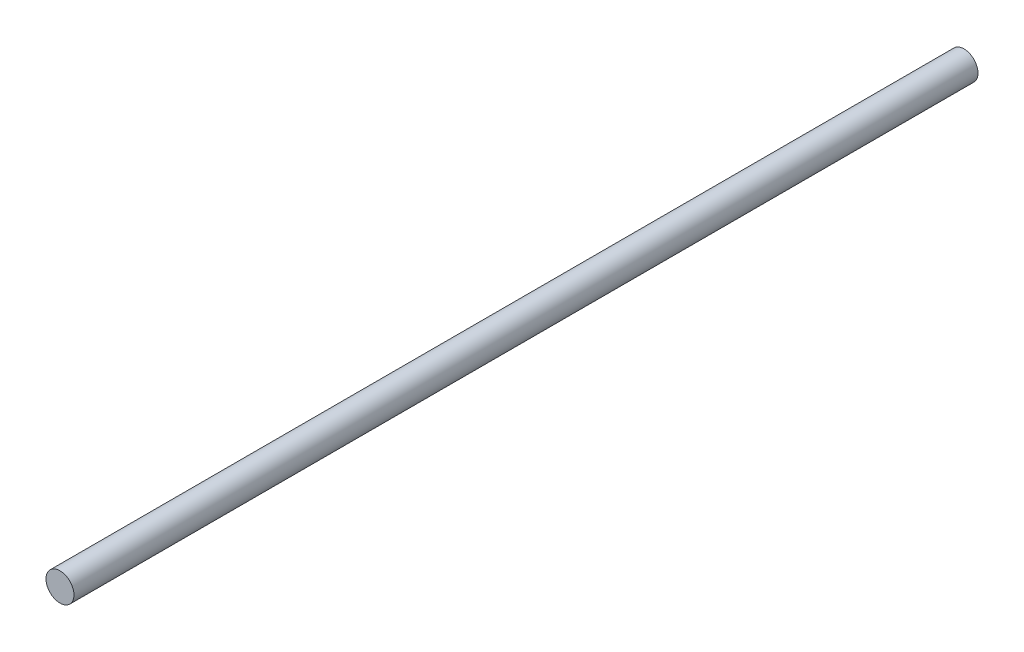
ISO-10303-21;
HEADER;
FILE_DESCRIPTION(('STEP AP214'),'2;1');
FILE_NAME('part.step','',(''),(''),'','','');
FILE_SCHEMA(('AUTOMOTIVE_DESIGN { 1 0 10303 214 1 1 1 1 }'));
ENDSEC;
DATA;
#1=APPLICATION_CONTEXT('core data for automotive mechanical design processes');
#2=APPLICATION_PROTOCOL_DEFINITION('international standard','automotive_design',2000,#1);
#3=PRODUCT_CONTEXT('',#1,'mechanical');
#4=PRODUCT('Part','Part','',(#3));
#5=PRODUCT_RELATED_PRODUCT_CATEGORY('part','',(#4));
#6=PRODUCT_DEFINITION_FORMATION('','',#4);
#7=PRODUCT_DEFINITION_CONTEXT('part definition',#1,'design');
#8=PRODUCT_DEFINITION('design','',#6,#7);
#9=PRODUCT_DEFINITION_SHAPE('','',#8);
#10=(LENGTH_UNIT() NAMED_UNIT(*) SI_UNIT(.MILLI.,.METRE.));
#11=(NAMED_UNIT(*) PLANE_ANGLE_UNIT() SI_UNIT($,.RADIAN.));
#12=(NAMED_UNIT(*) SI_UNIT($,.STERADIAN.) SOLID_ANGLE_UNIT());
#13=UNCERTAINTY_MEASURE_WITH_UNIT(LENGTH_MEASURE(1.E-05),#10,'distance_accuracy_value','');
#14=(GEOMETRIC_REPRESENTATION_CONTEXT(3) GLOBAL_UNCERTAINTY_ASSIGNED_CONTEXT((#13)) GLOBAL_UNIT_ASSIGNED_CONTEXT((#10,
#11,#12)) REPRESENTATION_CONTEXT('',''));
#15=CARTESIAN_POINT('',(0.,0.,0.));
#16=DIRECTION('',(0.,0.,1.));
#17=DIRECTION('',(1.,0.,0.));
#18=AXIS2_PLACEMENT_3D('',#15,#16,#17);
#19=CARTESIAN_POINT('',(0.,0.,177.5));
#20=DIRECTION('',(0.,0.,-1.));
#21=DIRECTION('',(-1.,0.,0.));
#22=AXIS2_PLACEMENT_3D('',#19,#20,#21);
#23=CYLINDRICAL_SURFACE('',#22,5.5);
#24=CARTESIAN_POINT('',(0.,0.,177.5));
#25=DIRECTION('',(0.,0.,1.));
#26=DIRECTION('',(1.,0.,0.));
#27=AXIS2_PLACEMENT_3D('',#24,#25,#26);
#28=CIRCLE('',#27,5.5);
#29=CARTESIAN_POINT('',(5.5,0.,177.5));
#30=VERTEX_POINT('',#29);
#31=EDGE_CURVE('E10',#30,#30,#28,.T.);
#32=ORIENTED_EDGE('',*,*,#31,.F.);
#33=EDGE_LOOP('',(#32));
#34=FACE_BOUND('',#33,.T.);
#35=CARTESIAN_POINT('',(0.,0.,-177.5));
#36=DIRECTION('',(0.,0.,1.));
#37=DIRECTION('',(1.,0.,0.));
#38=AXIS2_PLACEMENT_3D('',#35,#36,#37);
#39=CIRCLE('',#38,5.5);
#40=CARTESIAN_POINT('',(5.5,0.,-177.5));
#41=VERTEX_POINT('',#40);
#42=EDGE_CURVE('E36',#41,#41,#39,.T.);
#43=ORIENTED_EDGE('',*,*,#42,.T.);
#44=EDGE_LOOP('',(#43));
#45=FACE_BOUND('',#44,.T.);
#46=ADVANCED_FACE('F33',(#34,#45),#23,.T.);
#47=CARTESIAN_POINT('',(0.,0.,177.5));
#48=DIRECTION('',(0.,0.,1.));
#49=DIRECTION('',(1.,0.,0.));
#50=AXIS2_PLACEMENT_3D('',#47,#48,#49);
#51=PLANE('',#50);
#52=ORIENTED_EDGE('',*,*,#31,.T.);
#53=EDGE_LOOP('',(#52));
#54=FACE_BOUND('',#53,.T.);
#55=ADVANCED_FACE('F48',(#54),#51,.T.);
#56=CARTESIAN_POINT('',(0.,0.,-177.5));
#57=DIRECTION('',(0.,0.,1.));
#58=DIRECTION('',(1.,0.,0.));
#59=AXIS2_PLACEMENT_3D('',#56,#57,#58);
#60=PLANE('',#59);
#61=ORIENTED_EDGE('',*,*,#42,.F.);
#62=EDGE_LOOP('',(#61));
#63=FACE_BOUND('',#62,.T.);
#64=ADVANCED_FACE('F46',(#63),#60,.F.);
#65=CLOSED_SHELL('',(#46,#55,#64));
#66=MANIFOLD_SOLID_BREP('B2',#65);
#67=ADVANCED_BREP_SHAPE_REPRESENTATION('',(#18,#66),#14);
#68=SHAPE_DEFINITION_REPRESENTATION(#9,#67);
ENDSEC;
END-ISO-10303-21;
